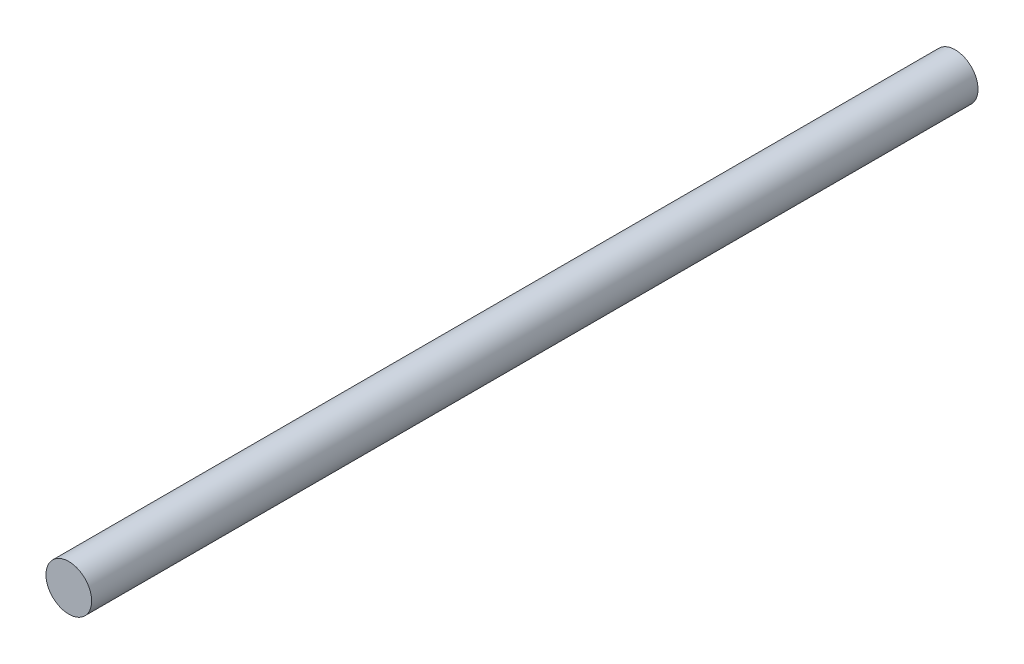
ISO-10303-21;
HEADER;
FILE_DESCRIPTION(('STEP AP214'),'2;1');
FILE_NAME('part.step','',(''),(''),'','','');
FILE_SCHEMA(('AUTOMOTIVE_DESIGN { 1 0 10303 214 1 1 1 1 }'));
ENDSEC;
DATA;
#1=APPLICATION_CONTEXT('core data for automotive mechanical design processes');
#2=APPLICATION_PROTOCOL_DEFINITION('international standard','automotive_design',2000,#1);
#3=PRODUCT_CONTEXT('',#1,'mechanical');
#4=PRODUCT('Part','Part','',(#3));
#5=PRODUCT_RELATED_PRODUCT_CATEGORY('part','',(#4));
#6=PRODUCT_DEFINITION_FORMATION('','',#4);
#7=PRODUCT_DEFINITION_CONTEXT('part definition',#1,'design');
#8=PRODUCT_DEFINITION('design','',#6,#7);
#9=PRODUCT_DEFINITION_SHAPE('','',#8);
#10=(LENGTH_UNIT() NAMED_UNIT(*) SI_UNIT(.MILLI.,.METRE.));
#11=(NAMED_UNIT(*) PLANE_ANGLE_UNIT() SI_UNIT($,.RADIAN.));
#12=(NAMED_UNIT(*) SI_UNIT($,.STERADIAN.) SOLID_ANGLE_UNIT());
#13=UNCERTAINTY_MEASURE_WITH_UNIT(LENGTH_MEASURE(1.E-05),#10,'distance_accuracy_value','');
#14=(GEOMETRIC_REPRESENTATION_CONTEXT(3) GLOBAL_UNCERTAINTY_ASSIGNED_CONTEXT((#13)) GLOBAL_UNIT_ASSIGNED_CONTEXT((#10,
#11,#12)) REPRESENTATION_CONTEXT('',''));
#15=CARTESIAN_POINT('',(0.,0.,0.));
#16=DIRECTION('',(0.,0.,1.));
#17=DIRECTION('',(1.,0.,0.));
#18=AXIS2_PLACEMENT_3D('',#15,#16,#17);
#19=CARTESIAN_POINT('',(0.,0.,97.));
#20=DIRECTION('',(0.,0.,-1.));
#21=DIRECTION('',(-1.,0.,0.));
#22=AXIS2_PLACEMENT_3D('',#19,#20,#21);
#23=CYLINDRICAL_SURFACE('',#22,2.5);
#24=CARTESIAN_POINT('',(0.,0.,97.));
#25=DIRECTION('',(0.,0.,1.));
#26=DIRECTION('',(1.,0.,0.));
#27=AXIS2_PLACEMENT_3D('',#24,#25,#26);
#28=CIRCLE('',#27,2.5);
#29=CARTESIAN_POINT('',(2.5,0.,97.));
#30=VERTEX_POINT('',#29);
#31=EDGE_CURVE('E10',#30,#30,#28,.T.);
#32=ORIENTED_EDGE('',*,*,#31,.F.);
#33=EDGE_LOOP('',(#32));
#34=FACE_BOUND('',#33,.T.);
#35=CARTESIAN_POINT('',(0.,0.,0.));
#36=DIRECTION('',(0.,0.,1.));
#37=DIRECTION('',(1.,0.,0.));
#38=AXIS2_PLACEMENT_3D('',#35,#36,#37);
#39=CIRCLE('',#38,2.5);
#40=CARTESIAN_POINT('',(2.5,0.,0.));
#41=VERTEX_POINT('',#40);
#42=EDGE_CURVE('E46',#41,#41,#39,.T.);
#43=ORIENTED_EDGE('',*,*,#42,.T.);
#44=EDGE_LOOP('',(#43));
#45=FACE_BOUND('',#44,.T.);
#46=ADVANCED_FACE('F43',(#34,#45),#23,.T.);
#47=CARTESIAN_POINT('',(0.,0.,97.));
#48=DIRECTION('',(0.,0.,1.));
#49=DIRECTION('',(1.,0.,0.));
#50=AXIS2_PLACEMENT_3D('',#47,#48,#49);
#51=PLANE('',#50);
#52=ORIENTED_EDGE('',*,*,#31,.T.);
#53=EDGE_LOOP('',(#52));
#54=FACE_BOUND('',#53,.T.);
#55=ADVANCED_FACE('F60',(#54),#51,.T.);
#56=CARTESIAN_POINT('',(0.,0.,0.));
#57=DIRECTION('',(0.,0.,1.));
#58=DIRECTION('',(1.,0.,0.));
#59=AXIS2_PLACEMENT_3D('',#56,#57,#58);
#60=PLANE('',#59);
#61=ORIENTED_EDGE('',*,*,#42,.F.);
#62=EDGE_LOOP('',(#61));
#63=FACE_BOUND('',#62,.T.);
#64=ADVANCED_FACE('F58',(#63),#60,.F.);
#65=CLOSED_SHELL('',(#46,#55,#64));
#66=MANIFOLD_SOLID_BREP('B2',#65);
#67=ADVANCED_BREP_SHAPE_REPRESENTATION('',(#18,#66),#14);
#68=SHAPE_DEFINITION_REPRESENTATION(#9,#67);
ENDSEC;
END-ISO-10303-21;
